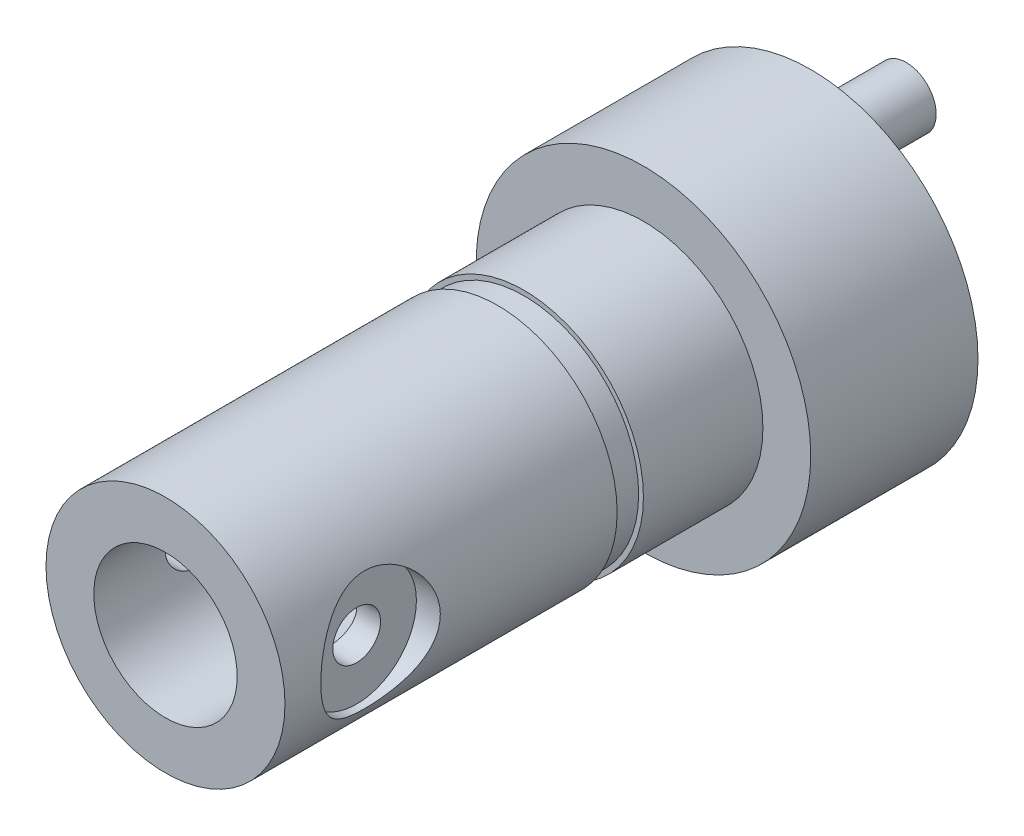
ISO-10303-21;
HEADER;
FILE_DESCRIPTION(('STEP AP214'),'2;1');
FILE_NAME('part.step','',(''),(''),'','','');
FILE_SCHEMA(('AUTOMOTIVE_DESIGN { 1 0 10303 214 1 1 1 1 }'));
ENDSEC;
DATA;
#1=APPLICATION_CONTEXT('core data for automotive mechanical design processes');
#2=APPLICATION_PROTOCOL_DEFINITION('international standard','automotive_design',2000,#1);
#3=PRODUCT_CONTEXT('',#1,'mechanical');
#4=PRODUCT('Part','Part','',(#3));
#5=PRODUCT_RELATED_PRODUCT_CATEGORY('part','',(#4));
#6=PRODUCT_DEFINITION_FORMATION('','',#4);
#7=PRODUCT_DEFINITION_CONTEXT('part definition',#1,'design');
#8=PRODUCT_DEFINITION('design','',#6,#7);
#9=PRODUCT_DEFINITION_SHAPE('','',#8);
#10=(LENGTH_UNIT() NAMED_UNIT(*) SI_UNIT(.MILLI.,.METRE.));
#11=(NAMED_UNIT(*) PLANE_ANGLE_UNIT() SI_UNIT($,.RADIAN.));
#12=(NAMED_UNIT(*) SI_UNIT($,.STERADIAN.) SOLID_ANGLE_UNIT());
#13=UNCERTAINTY_MEASURE_WITH_UNIT(LENGTH_MEASURE(1.E-05),#10,'distance_accuracy_value','');
#14=(GEOMETRIC_REPRESENTATION_CONTEXT(3) GLOBAL_UNCERTAINTY_ASSIGNED_CONTEXT((#13)) GLOBAL_UNIT_ASSIGNED_CONTEXT((#10,
#11,#12)) REPRESENTATION_CONTEXT('',''));
#15=CARTESIAN_POINT('',(0.,0.,0.));
#16=DIRECTION('',(0.,0.,1.));
#17=DIRECTION('',(1.,0.,0.));
#18=AXIS2_PLACEMENT_3D('',#15,#16,#17);
#19=CARTESIAN_POINT('',(-7.,0.,16.));
#20=DIRECTION('',(1.,0.,0.));
#21=DIRECTION('',(0.,0.,-1.));
#22=AXIS2_PLACEMENT_3D('',#19,#20,#21);
#23=CYLINDRICAL_SURFACE('',#22,1.);
#24=CARTESIAN_POINT('',(-3.,0.,15.));
#25=CARTESIAN_POINT('',(-3.00000015300943,0.0545633628867234,14.9999997462684));
#26=CARTESIAN_POINT('',(-2.99849769507545,0.10912519453855,15.0044802661272));
#27=CARTESIAN_POINT('',(-2.99265210203281,0.216641760872972,15.0222291088172));
#28=CARTESIAN_POINT('',(-2.98830867202153,0.269596328118818,15.0354983439489));
#29=CARTESIAN_POINT('',(-2.97725307906443,0.372332789501776,15.070319243384));
#30=CARTESIAN_POINT('',(-2.97054487730853,0.422119825886035,15.0918570624593));
#31=CARTESIAN_POINT('',(-2.95544445717342,0.517374936805325,15.1425411728383));
#32=CARTESIAN_POINT('',(-2.94705190667778,0.562842156958706,15.1716889650026));
#33=CARTESIAN_POINT('',(-2.92914094443005,0.649741675022267,15.2378258048588));
#34=CARTESIAN_POINT('',(-2.91959556463785,0.69100370029831,15.2750312342605));
#35=CARTESIAN_POINT('',(-2.90060314783122,0.766832692702085,15.3557671547066));
#36=CARTESIAN_POINT('',(-2.89115613290549,0.801398185489463,15.3992990349285));
#37=CARTESIAN_POINT('',(-2.87313332477274,0.86382494222786,15.4929851151965));
#38=CARTESIAN_POINT('',(-2.86459039275688,0.891464858221033,15.5432937397321));
#39=CARTESIAN_POINT('',(-2.84975305418601,0.937818873877723,15.6481760944585));
#40=CARTESIAN_POINT('',(-2.84345796160746,0.956535697386766,15.7027485171627));
#41=CARTESIAN_POINT('',(-2.83411303269377,0.983873461509165,15.8126732214967));
#42=CARTESIAN_POINT('',(-2.83096095769611,0.99281344827177,15.8679372084891));
#43=CARTESIAN_POINT('',(-2.82795656629508,1.00134112333448,15.9792637541559));
#44=CARTESIAN_POINT('',(-2.8281032302273,1.00093170160472,16.0353260607092));
#45=CARTESIAN_POINT('',(-2.8315901500818,0.991019903703421,16.143936630444));
#46=CARTESIAN_POINT('',(-2.83478415867533,0.981933913166996,16.196528402919));
#47=CARTESIAN_POINT('',(-2.84376657724551,0.955606162849419,16.2993934196068));
#48=CARTESIAN_POINT('',(-2.84955529784108,0.938363426591873,16.3496663854351));
#49=CARTESIAN_POINT('',(-2.86317911131249,0.895939058060213,16.4474127495915));
#50=CARTESIAN_POINT('',(-2.87104565793117,0.870634048707264,16.4948280254695));
#51=CARTESIAN_POINT('',(-2.88792558575726,0.812889106303141,16.5848709082797));
#52=CARTESIAN_POINT('',(-2.89693929790464,0.780447112364007,16.6274971269334));
#53=CARTESIAN_POINT('',(-2.91567329167741,0.70734933268224,16.7090915981608));
#54=CARTESIAN_POINT('',(-2.92540589354843,0.666353150076314,16.7477526945091));
#55=CARTESIAN_POINT('',(-2.94406938387037,0.578339569970067,16.8177312666634));
#56=CARTESIAN_POINT('',(-2.95300019538067,0.531321595660817,16.8490480381645));
#57=CARTESIAN_POINT('',(-2.96917107937794,0.43194761304627,16.9036963002351));
#58=CARTESIAN_POINT('',(-2.97639350008039,0.379543276416338,16.9269454913407));
#59=CARTESIAN_POINT('',(-2.98820567144435,0.271269083364508,16.9642031739557));
#60=CARTESIAN_POINT('',(-2.99279633654879,0.215400438154953,16.9782148754234));
#61=CARTESIAN_POINT('',(-2.99867627071441,0.104383829529303,16.9960556660224));
#62=CARTESIAN_POINT('',(-3.00010001833731,0.0493095998648445,17.0002998091728));
#63=CARTESIAN_POINT('',(-2.99988902694825,-0.0607750699602368,16.9996673264015));
#64=CARTESIAN_POINT('',(-2.99825480419352,-0.115785519319647,16.9947922400201));
#65=CARTESIAN_POINT('',(-2.99220024717114,-0.222519866304259,16.976388092264));
#66=CARTESIAN_POINT('',(-2.98786198711228,-0.274292806834857,16.9631137939505));
#67=CARTESIAN_POINT('',(-2.97691846830034,-0.374855958579562,16.9286065555333));
#68=CARTESIAN_POINT('',(-2.97031292046541,-0.423645788508561,16.9073726005323));
#69=CARTESIAN_POINT('',(-2.95528931287427,-0.518288296393322,16.8569295681591));
#70=CARTESIAN_POINT('',(-2.94682814756305,-0.56402995921733,16.8275254067164));
#71=CARTESIAN_POINT('',(-2.92905253915743,-0.650064830135404,16.7618058499869));
#72=CARTESIAN_POINT('',(-2.91973783591888,-0.690356367794894,16.7254883439698));
#73=CARTESIAN_POINT('',(-2.90076847982472,-0.766252507807013,16.6450212489917));
#74=CARTESIAN_POINT('',(-2.89111761095155,-0.801560969248491,16.6005907730668));
#75=CARTESIAN_POINT('',(-2.87299973286981,-0.864257522320854,16.5062284321955));
#76=CARTESIAN_POINT('',(-2.8645327335312,-0.891645547920844,16.4562965213898));
#77=CARTESIAN_POINT('',(-2.84982391820308,-0.937596930423361,16.3523269846934));
#78=CARTESIAN_POINT('',(-2.84357760900632,-0.956178132197767,16.2982979207572));
#79=CARTESIAN_POINT('',(-2.83410832399133,-0.983894666792164,16.1876213498759));
#80=CARTESIAN_POINT('',(-2.83088398622698,-0.993034254961244,16.1309750345669));
#81=CARTESIAN_POINT('',(-2.82797858875071,-1.00127628247038,16.0198029039868));
#82=CARTESIAN_POINT('',(-2.82812400344299,-1.00087025731093,15.9653176597483));
#83=CARTESIAN_POINT('',(-2.8315126992356,-0.991242293454879,15.8572349251003));
#84=CARTESIAN_POINT('',(-2.83475579595884,-0.982020879458888,15.8036373820471));
#85=CARTESIAN_POINT('',(-2.84384524278943,-0.955371813126981,15.6998643369873));
#86=CARTESIAN_POINT('',(-2.84964098015514,-0.938103346014881,15.6496431749928));
#87=CARTESIAN_POINT('',(-2.86316398825434,-0.895979365760383,15.5527725930645));
#88=CARTESIAN_POINT('',(-2.87089168765297,-0.871122168553981,15.5061239688127));
#89=CARTESIAN_POINT('',(-2.8878282922406,-0.813260692583251,15.4155163300763));
#90=CARTESIAN_POINT('',(-2.89708711641604,-0.779948242764533,15.3717634981014));
#91=CARTESIAN_POINT('',(-2.91583356283786,-0.706642883135698,15.290310186616));
#92=CARTESIAN_POINT('',(-2.92532124912518,-0.666648084451496,15.252611424312));
#93=CARTESIAN_POINT('',(-2.94390030525393,-0.579241556920676,15.1828555877108));
#94=CARTESIAN_POINT('',(-2.95296181801216,-0.531601513499727,15.151075652249));
#95=CARTESIAN_POINT('',(-2.96925991172652,-0.43135735740663,15.0960095711494));
#96=CARTESIAN_POINT('',(-2.9764969590794,-0.37875451813235,15.072721254078));
#97=CARTESIAN_POINT('',(-2.98805515068532,-0.272493647200976,15.0362783675113));
#98=CARTESIAN_POINT('',(-2.9924921242252,-0.218987757676409,15.0227175337366));
#99=CARTESIAN_POINT('',(-2.99846407064225,-0.110320416010248,15.0045797193229));
#100=CARTESIAN_POINT('',(-2.99999984531906,-0.0551594255687467,15.0000002565035));
#101=CARTESIAN_POINT('',(-3.,0.,15.));
#102=B_SPLINE_CURVE_WITH_KNOTS('',3,(#24,#25,#26,#27,#28,#29,#30,#31,#32,#33,#34,#35,#36,#37,
#38,#39,#40,#41,#42,#43,#44,#45,#46,#47,#48,#49,#50,#51,#52,#53,#54,#55,#56,#57,#58,#59,#60,#61,
#62,#63,#64,#65,#66,#67,#68,#69,#70,#71,#72,#73,#74,#75,#76,#77,#78,#79,#80,#81,#82,#83,#84,#85,
#86,#87,#88,#89,#90,#91,#92,#93,#94,#95,#96,#97,#98,#99,#100,#101),.UNSPECIFIED.,.T.,.F.,(4,2,2,
2,2,2,2,2,2,2,2,2,2,2,2,2,2,2,2,2,2,2,2,2,2,2,2,2,2,2,2,2,2,2,2,2,2,2,4),(0.,0.163487106026011,
0.326991185267521,0.490222672870274,0.653486377799101,0.82184684282756,0.990244332875303,
1.16348384823471,1.33667044692833,1.5040192574184,1.67131633987485,1.8309682655128,
1.99063930855482,2.15288171155131,2.31517102558207,2.48593305811367,2.65671145966618,
2.82918405650358,3.00159668877209,3.1665358317517,3.33144713164177,3.49158157978214,
3.65173645284104,3.81610399843737,3.98052180821892,4.15241022880752,4.32430008234997,
4.49584013824416,4.66730284700846,4.8299566605662,4.99260079341186,5.15215587070228,
5.31174638165788,5.47830066681616,5.6449021111359,5.81799660824911,5.99104681142267,
6.15636558363625,6.32163866027951),.UNSPECIFIED.);
#103=CARTESIAN_POINT('',(-3.,0.,15.));
#104=VERTEX_POINT('',#103);
#105=EDGE_CURVE('E101',#104,#104,#102,.T.);
#106=ORIENTED_EDGE('',*,*,#105,.T.);
#107=EDGE_LOOP('',(#106));
#108=FACE_BOUND('',#107,.T.);
#109=CARTESIAN_POINT('',(-4.,0.,16.));
#110=DIRECTION('',(-1.,0.,0.));
#111=DIRECTION('',(0.,0.,1.));
#112=AXIS2_PLACEMENT_3D('',#109,#110,#111);
#113=CIRCLE('',#112,1.);
#114=CARTESIAN_POINT('',(-4.,0.,17.));
#115=VERTEX_POINT('',#114);
#116=EDGE_CURVE('E45',#115,#115,#113,.F.);
#117=ORIENTED_EDGE('',*,*,#116,.F.);
#118=EDGE_LOOP('',(#117));
#119=FACE_BOUND('',#118,.T.);
#120=ADVANCED_FACE('F41',(#108,#119),#23,.F.);
#121=CARTESIAN_POINT('',(3.,0.,15.));
#122=CARTESIAN_POINT('',(3.00000015300943,-0.0545633628867234,14.9999997462684));
#123=CARTESIAN_POINT('',(2.99849769507545,-0.10912519453855,15.0044802661272));
#124=CARTESIAN_POINT('',(2.99265210203281,-0.216641760872972,15.0222291088172));
#125=CARTESIAN_POINT('',(2.98830867202153,-0.269596328118818,15.0354983439489));
#126=CARTESIAN_POINT('',(2.97725307906443,-0.372332789501776,15.070319243384));
#127=CARTESIAN_POINT('',(2.97054487730853,-0.422119825886035,15.0918570624593));
#128=CARTESIAN_POINT('',(2.95544445717342,-0.517374936805325,15.1425411728383));
#129=CARTESIAN_POINT('',(2.94705190667778,-0.562842156958706,15.1716889650026));
#130=CARTESIAN_POINT('',(2.92914094443005,-0.649741675022267,15.2378258048588));
#131=CARTESIAN_POINT('',(2.91959556463785,-0.69100370029831,15.2750312342605));
#132=CARTESIAN_POINT('',(2.90060314783122,-0.766832692702085,15.3557671547066));
#133=CARTESIAN_POINT('',(2.89115613290549,-0.801398185489463,15.3992990349285));
#134=CARTESIAN_POINT('',(2.87313332477274,-0.86382494222786,15.4929851151965));
#135=CARTESIAN_POINT('',(2.86459039275688,-0.891464858221033,15.5432937397321));
#136=CARTESIAN_POINT('',(2.84975305418601,-0.937818873877723,15.6481760944585));
#137=CARTESIAN_POINT('',(2.84345796160746,-0.956535697386766,15.7027485171627));
#138=CARTESIAN_POINT('',(2.83411303269377,-0.983873461509165,15.8126732214967));
#139=CARTESIAN_POINT('',(2.83096095769611,-0.99281344827177,15.8679372084891));
#140=CARTESIAN_POINT('',(2.82795656629508,-1.00134112333448,15.9792637541559));
#141=CARTESIAN_POINT('',(2.8281032302273,-1.00093170160472,16.0353260607092));
#142=CARTESIAN_POINT('',(2.8315901500818,-0.991019903703421,16.143936630444));
#143=CARTESIAN_POINT('',(2.83478415867533,-0.981933913166996,16.196528402919));
#144=CARTESIAN_POINT('',(2.84376657724551,-0.955606162849419,16.2993934196068));
#145=CARTESIAN_POINT('',(2.84955529784108,-0.938363426591873,16.3496663854351));
#146=CARTESIAN_POINT('',(2.86317911131249,-0.895939058060213,16.4474127495915));
#147=CARTESIAN_POINT('',(2.87104565793117,-0.870634048707264,16.4948280254695));
#148=CARTESIAN_POINT('',(2.88792558575726,-0.812889106303141,16.5848709082797));
#149=CARTESIAN_POINT('',(2.89693929790464,-0.780447112364007,16.6274971269334));
#150=CARTESIAN_POINT('',(2.91567329167741,-0.70734933268224,16.7090915981608));
#151=CARTESIAN_POINT('',(2.92540589354843,-0.666353150076314,16.7477526945091));
#152=CARTESIAN_POINT('',(2.94406938387037,-0.578339569970067,16.8177312666634));
#153=CARTESIAN_POINT('',(2.95300019538067,-0.531321595660817,16.8490480381645));
#154=CARTESIAN_POINT('',(2.96917107937794,-0.43194761304627,16.9036963002351));
#155=CARTESIAN_POINT('',(2.97639350008039,-0.379543276416338,16.9269454913407));
#156=CARTESIAN_POINT('',(2.98820567144435,-0.271269083364508,16.9642031739557));
#157=CARTESIAN_POINT('',(2.99279633654879,-0.215400438154953,16.9782148754234));
#158=CARTESIAN_POINT('',(2.99867627071441,-0.104383829529303,16.9960556660224));
#159=CARTESIAN_POINT('',(3.00010001833731,-0.0493095998648445,17.0002998091728));
#160=CARTESIAN_POINT('',(2.99988902694825,0.0607750699602368,16.9996673264015));
#161=CARTESIAN_POINT('',(2.99825480419352,0.115785519319647,16.9947922400201));
#162=CARTESIAN_POINT('',(2.99220024717114,0.222519866304259,16.976388092264));
#163=CARTESIAN_POINT('',(2.98786198711228,0.274292806834857,16.9631137939505));
#164=CARTESIAN_POINT('',(2.97691846830034,0.374855958579562,16.9286065555333));
#165=CARTESIAN_POINT('',(2.97031292046541,0.423645788508561,16.9073726005323));
#166=CARTESIAN_POINT('',(2.95528931287427,0.518288296393322,16.8569295681591));
#167=CARTESIAN_POINT('',(2.94682814756305,0.56402995921733,16.8275254067164));
#168=CARTESIAN_POINT('',(2.92905253915743,0.650064830135404,16.7618058499869));
#169=CARTESIAN_POINT('',(2.91973783591888,0.690356367794894,16.7254883439698));
#170=CARTESIAN_POINT('',(2.90076847982472,0.766252507807013,16.6450212489917));
#171=CARTESIAN_POINT('',(2.89111761095155,0.801560969248491,16.6005907730668));
#172=CARTESIAN_POINT('',(2.87299973286981,0.864257522320854,16.5062284321955));
#173=CARTESIAN_POINT('',(2.8645327335312,0.891645547920844,16.4562965213898));
#174=CARTESIAN_POINT('',(2.84982391820308,0.937596930423361,16.3523269846934));
#175=CARTESIAN_POINT('',(2.84357760900632,0.956178132197767,16.2982979207572));
#176=CARTESIAN_POINT('',(2.83410832399133,0.983894666792164,16.1876213498759));
#177=CARTESIAN_POINT('',(2.83088398622698,0.993034254961244,16.1309750345669));
#178=CARTESIAN_POINT('',(2.82797858875071,1.00127628247038,16.0198029039868));
#179=CARTESIAN_POINT('',(2.82812400344299,1.00087025731093,15.9653176597483));
#180=CARTESIAN_POINT('',(2.8315126992356,0.991242293454879,15.8572349251003));
#181=CARTESIAN_POINT('',(2.83475579595884,0.982020879458888,15.8036373820471));
#182=CARTESIAN_POINT('',(2.84384524278943,0.955371813126981,15.6998643369873));
#183=CARTESIAN_POINT('',(2.84964098015514,0.938103346014881,15.6496431749928));
#184=CARTESIAN_POINT('',(2.86316398825434,0.895979365760383,15.5527725930645));
#185=CARTESIAN_POINT('',(2.87089168765297,0.871122168553981,15.5061239688127));
#186=CARTESIAN_POINT('',(2.8878282922406,0.813260692583251,15.4155163300763));
#187=CARTESIAN_POINT('',(2.89708711641604,0.779948242764533,15.3717634981014));
#188=CARTESIAN_POINT('',(2.91583356283786,0.706642883135698,15.290310186616));
#189=CARTESIAN_POINT('',(2.92532124912518,0.666648084451496,15.252611424312));
#190=CARTESIAN_POINT('',(2.94390030525393,0.579241556920676,15.1828555877108));
#191=CARTESIAN_POINT('',(2.95296181801216,0.531601513499727,15.151075652249));
#192=CARTESIAN_POINT('',(2.96925991172652,0.43135735740663,15.0960095711494));
#193=CARTESIAN_POINT('',(2.9764969590794,0.37875451813235,15.072721254078));
#194=CARTESIAN_POINT('',(2.98805515068532,0.272493647200976,15.0362783675113));
#195=CARTESIAN_POINT('',(2.9924921242252,0.218987757676409,15.0227175337366));
#196=CARTESIAN_POINT('',(2.99846407064225,0.110320416010248,15.0045797193229));
#197=CARTESIAN_POINT('',(2.99999984531906,0.0551594255687467,15.0000002565035));
#198=CARTESIAN_POINT('',(3.,0.,15.));
#199=B_SPLINE_CURVE_WITH_KNOTS('',3,(#121,#122,#123,#124,#125,#126,#127,#128,#129,#130,#131,
#132,#133,#134,#135,#136,#137,#138,#139,#140,#141,#142,#143,#144,#145,#146,#147,#148,#149,#150,
#151,#152,#153,#154,#155,#156,#157,#158,#159,#160,#161,#162,#163,#164,#165,#166,#167,#168,#169,
#170,#171,#172,#173,#174,#175,#176,#177,#178,#179,#180,#181,#182,#183,#184,#185,#186,#187,#188,
#189,#190,#191,#192,#193,#194,#195,#196,#197,#198),.UNSPECIFIED.,.T.,.F.,(4,2,2,2,2,2,2,2,2,2,2,
2,2,2,2,2,2,2,2,2,2,2,2,2,2,2,2,2,2,2,2,2,2,2,2,2,2,2,4),(0.,0.163487106026011,
0.326991185267521,0.490222672870274,0.653486377799101,0.82184684282756,0.990244332875303,
1.16348384823471,1.33667044692833,1.5040192574184,1.67131633987485,1.8309682655128,
1.99063930855482,2.15288171155131,2.31517102558207,2.48593305811367,2.65671145966618,
2.82918405650358,3.00159668877209,3.1665358317517,3.33144713164177,3.49158157978214,
3.65173645284104,3.81610399843737,3.98052180821892,4.15241022880752,4.32430008234997,
4.49584013824416,4.66730284700846,4.8299566605662,4.99260079341186,5.15215587070228,
5.31174638165788,5.47830066681616,5.6449021111359,5.81799660824911,5.99104681142267,
6.15636558363625,6.32163866027951),.UNSPECIFIED.);
#200=CARTESIAN_POINT('',(3.,0.,15.));
#201=VERTEX_POINT('',#200);
#202=EDGE_CURVE('E95',#201,#201,#199,.T.);
#203=ORIENTED_EDGE('',*,*,#202,.T.);
#204=EDGE_LOOP('',(#203));
#205=FACE_BOUND('',#204,.T.);
#206=CARTESIAN_POINT('',(4.,0.,16.));
#207=DIRECTION('',(1.,0.,0.));
#208=DIRECTION('',(0.,0.,-1.));
#209=AXIS2_PLACEMENT_3D('',#206,#207,#208);
#210=CIRCLE('',#209,1.);
#211=CARTESIAN_POINT('',(4.,0.,15.));
#212=VERTEX_POINT('',#211);
#213=EDGE_CURVE('E131',#212,#212,#210,.F.);
#214=ORIENTED_EDGE('',*,*,#213,.F.);
#215=EDGE_LOOP('',(#214));
#216=FACE_BOUND('',#215,.T.);
#217=ADVANCED_FACE('F87',(#205,#216),#23,.F.);
#218=CARTESIAN_POINT('',(0.,0.,20.));
#219=DIRECTION('',(0.,0.,-1.));
#220=DIRECTION('',(-1.,0.,0.));
#221=AXIS2_PLACEMENT_3D('',#218,#219,#220);
#222=CYLINDRICAL_SURFACE('',#221,5.);
#223=CARTESIAN_POINT('',(0.,0.,20.));
#224=DIRECTION('',(0.,0.,1.));
#225=DIRECTION('',(1.,0.,0.));
#226=AXIS2_PLACEMENT_3D('',#223,#224,#225);
#227=CIRCLE('',#226,5.);
#228=CARTESIAN_POINT('',(5.,0.,20.));
#229=VERTEX_POINT('',#228);
#230=EDGE_CURVE('E285',#229,#229,#227,.T.);
#231=ORIENTED_EDGE('',*,*,#230,.F.);
#232=EDGE_LOOP('',(#231));
#233=FACE_BOUND('',#232,.T.);
#234=CARTESIAN_POINT('',(0.,0.,6.1));
#235=DIRECTION('',(0.,0.,1.));
#236=DIRECTION('',(1.,0.,0.));
#237=AXIS2_PLACEMENT_3D('',#234,#235,#236);
#238=CIRCLE('',#237,5.);
#239=CARTESIAN_POINT('',(5.,0.,6.1));
#240=VERTEX_POINT('',#239);
#241=EDGE_CURVE('E290',#240,#240,#238,.T.);
#242=ORIENTED_EDGE('',*,*,#241,.T.);
#243=EDGE_LOOP('',(#242));
#244=FACE_BOUND('',#243,.T.);
#245=CARTESIAN_POINT('',(5.,0.,13.5));
#246=CARTESIAN_POINT('',(4.99999177550472,-0.131426682334305,13.500009669056));
#247=CARTESIAN_POINT('',(4.99476199135277,-0.263015634437212,13.510425561774));
#248=CARTESIAN_POINT('',(4.9743541856102,-0.522301454622882,13.5516318211621));
#249=CARTESIAN_POINT('',(4.9591572718767,-0.649990448564104,13.582460880925));
#250=CARTESIAN_POINT('',(4.92040690922477,-0.897333631316202,13.6629846227188));
#251=CARTESIAN_POINT('',(4.89688595907259,-1.01701694536277,13.7126059877827));
#252=CARTESIAN_POINT('',(4.84364443325827,-1.24618160399671,13.8289265262518));
#253=CARTESIAN_POINT('',(4.81392434644421,-1.3556637520377,13.8956243531451));
#254=CARTESIAN_POINT('',(4.74890645050632,-1.56876952630998,14.0487931316426));
#255=CARTESIAN_POINT('',(4.71337997659091,-1.67163802294308,14.1362162002298));
#256=CARTESIAN_POINT('',(4.64149925776731,-1.86194861703332,14.3263036959853));
#257=CARTESIAN_POINT('',(4.60514440566897,-1.94937895911555,14.4289796288401));
#258=CARTESIAN_POINT('',(4.53247377945622,-2.11312999967247,14.6562083744453));
#259=CARTESIAN_POINT('',(4.49637967412567,-2.18806333849064,14.781840246035));
#260=CARTESIAN_POINT('',(4.43214946943555,-2.31542056761491,15.0459183397954));
#261=CARTESIAN_POINT('',(4.40400769020792,-2.36786053751682,15.1843553217626));
#262=CARTESIAN_POINT('',(4.36144667591402,-2.44533110537653,15.4616627635964));
#263=CARTESIAN_POINT('',(4.34630678958452,-2.47181464267578,15.6000111301796));
#264=CARTESIAN_POINT('',(4.3295472487215,-2.50106748329741,15.8799470944376));
#265=CARTESIAN_POINT('',(4.3279142335843,-2.50386022093906,16.0215313521751));
#266=CARTESIAN_POINT('',(4.33777325642937,-2.48671821792512,16.2857150607909));
#267=CARTESIAN_POINT('',(4.34771909154984,-2.46946139884055,16.4085600780583));
#268=CARTESIAN_POINT('',(4.37690571834675,-2.41734962264384,16.6493047734319));
#269=CARTESIAN_POINT('',(4.39614947079454,-2.38248905974454,16.7672028632631));
#270=CARTESIAN_POINT('',(4.44218691031839,-2.29552445096459,16.9980728314143));
#271=CARTESIAN_POINT('',(4.46914601659993,-2.24303766778987,17.1108659969645));
#272=CARTESIAN_POINT('',(4.52758510703513,-2.12260421917012,17.326585731475));
#273=CARTESIAN_POINT('',(4.55906711950478,-2.0546506095312,17.4295078390002));
#274=CARTESIAN_POINT('',(4.62782894758213,-1.89516513728194,17.6363031318581));
#275=CARTESIAN_POINT('',(4.66533775591865,-1.80173614592319,17.7386421839404));
#276=CARTESIAN_POINT('',(4.73869058251019,-1.59888894685344,17.9268385464772));
#277=CARTESIAN_POINT('',(4.77453379897003,-1.48946314143571,18.0126879800847));
#278=CARTESIAN_POINT('',(4.84254968207409,-1.25129126457962,18.1692141525743));
#279=CARTESIAN_POINT('',(4.87447460405015,-1.12188397899853,18.2390011811144));
#280=CARTESIAN_POINT('',(4.92894702803109,-0.851165538721983,18.3552425726075));
#281=CARTESIAN_POINT('',(4.95150197358893,-0.70986394066316,18.4017154625379));
#282=CARTESIAN_POINT('',(4.98310834353579,-0.431916229151779,18.4661885092917));
#283=CARTESIAN_POINT('',(4.9931234575324,-0.295853826370905,18.486228089367));
#284=CARTESIAN_POINT('',(5.00182533647794,-0.0219489998732879,18.5036618278362));
#285=CARTESIAN_POINT('',(5.00051746803426,0.115892549675109,18.5010667140985));
#286=CARTESIAN_POINT('',(4.98727980633468,0.378082429964656,18.4744832789533));
#287=CARTESIAN_POINT('',(4.97618114219992,0.502648520123705,18.4521686681756));
#288=CARTESIAN_POINT('',(4.94555428287529,0.746017230755971,18.3894048202616));
#289=CARTESIAN_POINT('',(4.92602515837625,0.864819214231882,18.3489535838641));
#290=CARTESIAN_POINT('',(4.87960628532329,1.09722152111965,18.2500038339196));
#291=CARTESIAN_POINT('',(4.85252204417873,1.21057599249831,18.1910223747177));
#292=CARTESIAN_POINT('',(4.7935993579975,1.42615340426439,18.0572311608752));
#293=CARTESIAN_POINT('',(4.76175888940534,1.52837157450203,17.9824146634801));
#294=CARTESIAN_POINT('',(4.69270553315087,1.72941922315487,17.8105989367091));
#295=CARTESIAN_POINT('',(4.65527212009488,1.82693019428496,17.7121428290248));
#296=CARTESIAN_POINT('',(4.58155978921587,2.0046408025722,17.5001871219506));
#297=CARTESIAN_POINT('',(4.54528168472407,2.08482846428685,17.3866772029301));
#298=CARTESIAN_POINT('',(4.4762798054528,2.22926978618995,17.1408908645153));
#299=CARTESIAN_POINT('',(4.44381323981254,2.29256373922243,17.0079718347089));
#300=CARTESIAN_POINT('',(4.38935180726746,2.39520706511459,16.7312248311174));
#301=CARTESIAN_POINT('',(4.36734345549014,2.43458729077055,16.587411184));
#302=CARTESIAN_POINT('',(4.33903752569351,2.48465421767005,16.3077244426371));
#303=CARTESIAN_POINT('',(4.33143458674096,2.4977324874436,16.172414365881));
#304=CARTESIAN_POINT('',(4.32913386592579,2.50172288950898,15.9013823326193));
#305=CARTESIAN_POINT('',(4.33443049025111,2.49264462983266,15.7656605801264));
#306=CARTESIAN_POINT('',(4.35594655164663,2.45481530197331,15.5112912443832));
#307=CARTESIAN_POINT('',(4.37107736338133,2.42802074302696,15.3922488182792));
#308=CARTESIAN_POINT('',(4.40927540337602,2.35793843840543,15.1604797078));
#309=CARTESIAN_POINT('',(4.43234518434965,2.31464538728732,15.0477550684335));
#310=CARTESIAN_POINT('',(4.48571326433413,2.20953919315538,14.8234378472803));
#311=CARTESIAN_POINT('',(4.5163930799845,2.14667719009403,14.712430148265));
#312=CARTESIAN_POINT('',(4.58088327077455,2.0053780838799,14.50181375676));
#313=CARTESIAN_POINT('',(4.61469526970767,1.92693287765888,14.4022110373713));
#314=CARTESIAN_POINT('',(4.68655816327011,1.74550556946065,14.2046446362504));
#315=CARTESIAN_POINT('',(4.72462491514981,1.6407002246921,14.1083506358286));
#316=CARTESIAN_POINT('',(4.79694347383545,1.41539785420684,13.934344150572));
#317=CARTESIAN_POINT('',(4.83119321905446,1.29489242426332,13.8566416813941));
#318=CARTESIAN_POINT('',(4.89245149457782,1.03978808878536,13.7219030205159));
#319=CARTESIAN_POINT('',(4.91940711437488,0.905095560782285,13.6650168322155));
#320=CARTESIAN_POINT('',(4.95177960923351,0.696328709257349,13.5978161412076));
#321=CARTESIAN_POINT('',(4.96122314081874,0.625670413494086,13.5784446019982));
#322=CARTESIAN_POINT('',(4.97717127275101,0.482623997839256,13.5459340516294));
#323=CARTESIAN_POINT('',(4.98367766823159,0.4102369630924,13.5327912333237));
#324=CARTESIAN_POINT('',(4.9923820076613,0.28151868462167,13.5152625277154));
#325=CARTESIAN_POINT('',(4.99523288466454,0.225408499555444,13.5095450634687));
#326=CARTESIAN_POINT('',(4.99904367329659,0.112875528456289,13.5019116705343));
#327=CARTESIAN_POINT('',(5.00000353273198,0.056452733838218,13.4999958467745));
#328=CARTESIAN_POINT('',(5.,0.,13.5));
#329=B_SPLINE_CURVE_WITH_KNOTS('',3,(#245,#246,#247,#248,#249,#250,#251,#252,#253,#254,#255,
#256,#257,#258,#259,#260,#261,#262,#263,#264,#265,#266,#267,#268,#269,#270,#271,#272,#273,#274,
#275,#276,#277,#278,#279,#280,#281,#282,#283,#284,#285,#286,#287,#288,#289,#290,#291,#292,#293,
#294,#295,#296,#297,#298,#299,#300,#301,#302,#303,#304,#305,#306,#307,#308,#309,#310,#311,#312,
#313,#314,#315,#316,#317,#318,#319,#320,#321,#322,#323,#324,#325,#326,#327,#328),.UNSPECIFIED.,
.T.,.F.,(4,2,2,2,2,2,2,2,2,2,2,2,2,2,2,2,2,2,2,2,2,2,2,2,2,2,2,2,2,2,2,2,2,2,2,2,2,2,2,2,2,4),
(0.,0.394060643550731,0.788870374272993,1.18215538873075,1.57540940145392,1.99245439679522,
2.40981559413509,2.85954316076882,3.30894869745702,3.73145030350574,4.1535339332255,
4.52514281023301,4.89687009814196,5.27725600421218,5.65781303150554,6.08662353334696,
6.51563836496716,6.96457555536101,7.41315542280699,7.82458226178364,8.2358141127869,
8.61517266265304,8.99457304077328,9.38482140069746,9.77523626870848,10.2039902661037,
10.6330397153795,11.0828670540368,11.53211279863,11.9382326875698,12.3441764966106,
12.7114482562151,13.0788382197025,13.4709114195009,13.8631890285845,14.303131068923,
14.7433095845248,15.1866003415819,15.407934939208,15.6291340766843,15.7983933645035,
15.9676573239322),.UNSPECIFIED.);
#330=CARTESIAN_POINT('',(5.,0.,13.5));
#331=VERTEX_POINT('',#330);
#332=EDGE_CURVE('E49',#331,#331,#329,.T.);
#333=ORIENTED_EDGE('',*,*,#332,.T.);
#334=EDGE_LOOP('',(#333));
#335=FACE_BOUND('',#334,.T.);
#336=CARTESIAN_POINT('',(-5.,0.,18.5));
#337=CARTESIAN_POINT('',(-4.99999177550472,0.131426682334305,18.499990330944));
#338=CARTESIAN_POINT('',(-4.99476199135277,0.263015634437212,18.489574438226));
#339=CARTESIAN_POINT('',(-4.9743541856102,0.522301454622882,18.4483681788379));
#340=CARTESIAN_POINT('',(-4.9591572718767,0.649990448564105,18.417539119075));
#341=CARTESIAN_POINT('',(-4.92040690922477,0.897333631316203,18.3370153772812));
#342=CARTESIAN_POINT('',(-4.89688595907259,1.01701694536277,18.2873940122173));
#343=CARTESIAN_POINT('',(-4.84364443325827,1.24618160399671,18.1710734737482));
#344=CARTESIAN_POINT('',(-4.81392434644421,1.3556637520377,18.1043756468549));
#345=CARTESIAN_POINT('',(-4.74890645050632,1.56876952630998,17.9512068683574));
#346=CARTESIAN_POINT('',(-4.71337997659091,1.67163802294308,17.8637837997702));
#347=CARTESIAN_POINT('',(-4.64149925776731,1.86194861703332,17.6736963040147));
#348=CARTESIAN_POINT('',(-4.60514440566897,1.94937895911555,17.5710203711599));
#349=CARTESIAN_POINT('',(-4.53247377945622,2.11312999967247,17.3437916255547));
#350=CARTESIAN_POINT('',(-4.49637967412567,2.18806333849064,17.218159753965));
#351=CARTESIAN_POINT('',(-4.43214946943555,2.31542056761491,16.9540816602046));
#352=CARTESIAN_POINT('',(-4.40400769020792,2.36786053751682,16.8156446782374));
#353=CARTESIAN_POINT('',(-4.36144667591402,2.44533110537653,16.5383372364036));
#354=CARTESIAN_POINT('',(-4.34630678958452,2.47181464267578,16.3999888698204));
#355=CARTESIAN_POINT('',(-4.3295472487215,2.50106748329741,16.1200529055624));
#356=CARTESIAN_POINT('',(-4.3279142335843,2.50386022093906,15.9784686478249));
#357=CARTESIAN_POINT('',(-4.33777325642937,2.48671821792512,15.7142849392091));
#358=CARTESIAN_POINT('',(-4.34771909154984,2.46946139884055,15.5914399219417));
#359=CARTESIAN_POINT('',(-4.37690571834675,2.41734962264384,15.3506952265681));
#360=CARTESIAN_POINT('',(-4.39614947079454,2.38248905974454,15.2327971367369));
#361=CARTESIAN_POINT('',(-4.44218691031839,2.29552445096459,15.0019271685857));
#362=CARTESIAN_POINT('',(-4.46914601659993,2.24303766778987,14.8891340030355));
#363=CARTESIAN_POINT('',(-4.52758510703513,2.12260421917012,14.673414268525));
#364=CARTESIAN_POINT('',(-4.55906711950478,2.0546506095312,14.5704921609998));
#365=CARTESIAN_POINT('',(-4.62782894758213,1.89516513728193,14.3636968681419));
#366=CARTESIAN_POINT('',(-4.66533775591865,1.80173614592319,14.2613578160596));
#367=CARTESIAN_POINT('',(-4.73869058251019,1.59888894685344,14.0731614535228));
#368=CARTESIAN_POINT('',(-4.77453379897003,1.48946314143571,13.9873120199153));
#369=CARTESIAN_POINT('',(-4.84254968207409,1.25129126457962,13.8307858474257));
#370=CARTESIAN_POINT('',(-4.87447460405015,1.12188397899853,13.7609988188856));
#371=CARTESIAN_POINT('',(-4.92894702803109,0.851165538721983,13.6447574273925));
#372=CARTESIAN_POINT('',(-4.95150197358893,0.709863940663161,13.5982845374621));
#373=CARTESIAN_POINT('',(-4.98310834353579,0.43191622915178,13.5338114907083));
#374=CARTESIAN_POINT('',(-4.9931234575324,0.295853826370905,13.513771910633));
#375=CARTESIAN_POINT('',(-5.00182533647794,0.0219489998732874,13.4963381721638));
#376=CARTESIAN_POINT('',(-5.00051746803426,-0.11589254967511,13.4989332859015));
#377=CARTESIAN_POINT('',(-4.98727980633468,-0.378082429964657,13.5255167210467));
#378=CARTESIAN_POINT('',(-4.97618114219992,-0.502648520123706,13.5478313318244));
#379=CARTESIAN_POINT('',(-4.94555428287529,-0.746017230755972,13.6105951797384));
#380=CARTESIAN_POINT('',(-4.92602515837625,-0.864819214231883,13.6510464161359));
#381=CARTESIAN_POINT('',(-4.87960628532329,-1.09722152111965,13.7499961660804));
#382=CARTESIAN_POINT('',(-4.85252204417873,-1.21057599249831,13.8089776252823));
#383=CARTESIAN_POINT('',(-4.7935993579975,-1.42615340426439,13.9427688391248));
#384=CARTESIAN_POINT('',(-4.76175888940534,-1.52837157450203,14.0175853365199));
#385=CARTESIAN_POINT('',(-4.69270553315087,-1.72941922315487,14.1894010632909));
#386=CARTESIAN_POINT('',(-4.65527212009488,-1.82693019428496,14.2878571709752));
#387=CARTESIAN_POINT('',(-4.58155978921587,-2.0046408025722,14.4998128780494));
#388=CARTESIAN_POINT('',(-4.54528168472407,-2.08482846428685,14.6133227970699));
#389=CARTESIAN_POINT('',(-4.4762798054528,-2.22926978618995,14.8591091354847));
#390=CARTESIAN_POINT('',(-4.44381323981254,-2.29256373922243,14.9920281652911));
#391=CARTESIAN_POINT('',(-4.38935180726746,-2.39520706511459,15.2687751688826));
#392=CARTESIAN_POINT('',(-4.36734345549014,-2.43458729077055,15.412588816));
#393=CARTESIAN_POINT('',(-4.33903752569351,-2.48465421767005,15.6922755573629));
#394=CARTESIAN_POINT('',(-4.33143458674096,-2.4977324874436,15.827585634119));
#395=CARTESIAN_POINT('',(-4.32913386592579,-2.50172288950898,16.0986176673807));
#396=CARTESIAN_POINT('',(-4.33443049025111,-2.49264462983266,16.2343394198736));
#397=CARTESIAN_POINT('',(-4.35594655164663,-2.45481530197332,16.4887087556168));
#398=CARTESIAN_POINT('',(-4.37107736338133,-2.42802074302696,16.6077511817208));
#399=CARTESIAN_POINT('',(-4.40927540337602,-2.35793843840544,16.8395202922));
#400=CARTESIAN_POINT('',(-4.43234518434965,-2.31464538728732,16.9522449315665));
#401=CARTESIAN_POINT('',(-4.48571326433413,-2.20953919315538,17.1765621527197));
#402=CARTESIAN_POINT('',(-4.5163930799845,-2.14667719009403,17.287569851735));
#403=CARTESIAN_POINT('',(-4.58088327077455,-2.0053780838799,17.49818624324));
#404=CARTESIAN_POINT('',(-4.61469526970767,-1.92693287765888,17.5977889626287));
#405=CARTESIAN_POINT('',(-4.68655816327011,-1.74550556946065,17.7953553637496));
#406=CARTESIAN_POINT('',(-4.72462491514981,-1.64070022469209,17.8916493641714));
#407=CARTESIAN_POINT('',(-4.79694347383545,-1.41539785420683,18.065655849428));
#408=CARTESIAN_POINT('',(-4.83119321905446,-1.29489242426332,18.1433583186059));
#409=CARTESIAN_POINT('',(-4.89245149457782,-1.03978808878536,18.2780969794841));
#410=CARTESIAN_POINT('',(-4.91940711437488,-0.905095560782286,18.3349831677845));
#411=CARTESIAN_POINT('',(-4.9517796092335,-0.69632870925735,18.4021838587924));
#412=CARTESIAN_POINT('',(-4.96122314081874,-0.625670413494087,18.4215553980018));
#413=CARTESIAN_POINT('',(-4.97717127275101,-0.482623997839256,18.4540659483706));
#414=CARTESIAN_POINT('',(-4.98367766823159,-0.4102369630924,18.4672087666763));
#415=CARTESIAN_POINT('',(-4.9923820076613,-0.28151868462167,18.4847374722846));
#416=CARTESIAN_POINT('',(-4.99523288466454,-0.225408499555444,18.4904549365313));
#417=CARTESIAN_POINT('',(-4.99904367329659,-0.112875528456289,18.4980883294657));
#418=CARTESIAN_POINT('',(-5.00000353273198,-0.056452733838218,18.5000041532255));
#419=CARTESIAN_POINT('',(-5.,0.,18.5));
#420=B_SPLINE_CURVE_WITH_KNOTS('',3,(#336,#337,#338,#339,#340,#341,#342,#343,#344,#345,#346,
#347,#348,#349,#350,#351,#352,#353,#354,#355,#356,#357,#358,#359,#360,#361,#362,#363,#364,#365,
#366,#367,#368,#369,#370,#371,#372,#373,#374,#375,#376,#377,#378,#379,#380,#381,#382,#383,#384,
#385,#386,#387,#388,#389,#390,#391,#392,#393,#394,#395,#396,#397,#398,#399,#400,#401,#402,#403,
#404,#405,#406,#407,#408,#409,#410,#411,#412,#413,#414,#415,#416,#417,#418,#419),.UNSPECIFIED.,
.T.,.F.,(4,2,2,2,2,2,2,2,2,2,2,2,2,2,2,2,2,2,2,2,2,2,2,2,2,2,2,2,2,2,2,2,2,2,2,2,2,2,2,2,2,4),
(0.,0.394060643550731,0.788870374272994,1.18215538873075,1.57540940145392,1.99245439679522,
2.40981559413509,2.85954316076881,3.30894869745702,3.73145030350574,4.15353393322551,
4.52514281023301,4.89687009814196,5.27725600421218,5.65781303150554,6.08662353334696,
6.51563836496716,6.96457555536101,7.41315542280698,7.82458226178364,8.2358141127869,
8.61517266265304,8.99457304077328,9.38482140069746,9.77523626870848,10.2039902661037,
10.6330397153795,11.0828670540368,11.53211279863,11.9382326875698,12.3441764966106,
12.7114482562151,13.0788382197025,13.4709114195009,13.8631890285845,14.303131068923,
14.7433095845248,15.1866003415818,15.407934939208,15.6291340766843,15.7983933645035,
15.9676573239322),.UNSPECIFIED.);
#421=CARTESIAN_POINT('',(-5.,0.,18.5));
#422=VERTEX_POINT('',#421);
#423=EDGE_CURVE('E10',#422,#422,#420,.T.);
#424=ORIENTED_EDGE('',*,*,#423,.F.);
#425=EDGE_LOOP('',(#424));
#426=FACE_BOUND('',#425,.T.);
#427=ADVANCED_FACE('F65',(#233,#244,#335,#426),#222,.T.);
#428=CARTESIAN_POINT('',(0.,0.,0.));
#429=DIRECTION('',(0.,0.,1.));
#430=DIRECTION('',(1.,0.,0.));
#431=AXIS2_PLACEMENT_3D('',#428,#429,#430);
#432=CIRCLE('',#431,5.);
#433=CARTESIAN_POINT('',(5.,0.,0.));
#434=VERTEX_POINT('',#433);
#435=EDGE_CURVE('E287',#434,#434,#432,.T.);
#436=ORIENTED_EDGE('',*,*,#435,.T.);
#437=EDGE_LOOP('',(#436));
#438=FACE_BOUND('',#437,.T.);
#439=CARTESIAN_POINT('',(0.,0.,5.));
#440=DIRECTION('',(0.,0.,1.));
#441=DIRECTION('',(1.,0.,0.));
#442=AXIS2_PLACEMENT_3D('',#439,#440,#441);
#443=CIRCLE('',#442,5.);
#444=CARTESIAN_POINT('',(5.,0.,5.));
#445=VERTEX_POINT('',#444);
#446=EDGE_CURVE('E294',#445,#445,#443,.T.);
#447=ORIENTED_EDGE('',*,*,#446,.F.);
#448=EDGE_LOOP('',(#447));
#449=FACE_BOUND('',#448,.T.);
#450=ADVANCED_FACE('F186',(#438,#449),#222,.T.);
#451=CARTESIAN_POINT('',(0.,0.,-7.));
#452=DIRECTION('',(0.,0.,1.));
#453=DIRECTION('',(1.,0.,0.));
#454=AXIS2_PLACEMENT_3D('',#451,#452,#453);
#455=CYLINDRICAL_SURFACE('',#454,7.);
#456=CARTESIAN_POINT('',(0.,0.,-7.));
#457=DIRECTION('',(0.,0.,1.));
#458=DIRECTION('',(1.,0.,0.));
#459=AXIS2_PLACEMENT_3D('',#456,#457,#458);
#460=CIRCLE('',#459,7.);
#461=CARTESIAN_POINT('',(7.,0.,-7.));
#462=VERTEX_POINT('',#461);
#463=EDGE_CURVE('E280',#462,#462,#460,.T.);
#464=ORIENTED_EDGE('',*,*,#463,.T.);
#465=EDGE_LOOP('',(#464));
#466=FACE_BOUND('',#465,.T.);
#467=CARTESIAN_POINT('',(0.,0.,0.));
#468=DIRECTION('',(0.,0.,1.));
#469=DIRECTION('',(1.,0.,0.));
#470=AXIS2_PLACEMENT_3D('',#467,#468,#469);
#471=CIRCLE('',#470,7.);
#472=CARTESIAN_POINT('',(7.,0.,0.));
#473=VERTEX_POINT('',#472);
#474=EDGE_CURVE('E283',#473,#473,#471,.T.);
#475=ORIENTED_EDGE('',*,*,#474,.F.);
#476=EDGE_LOOP('',(#475));
#477=FACE_BOUND('',#476,.T.);
#478=ADVANCED_FACE('F43',(#466,#477),#455,.T.);
#479=CARTESIAN_POINT('',(0.,0.,-7.));
#480=DIRECTION('',(0.,0.,1.));
#481=DIRECTION('',(1.,0.,0.));
#482=AXIS2_PLACEMENT_3D('',#479,#480,#481);
#483=PLANE('',#482);
#484=CARTESIAN_POINT('',(0.,4.,-7.));
#485=DIRECTION('',(0.,0.,1.));
#486=DIRECTION('',(1.,0.,0.));
#487=AXIS2_PLACEMENT_3D('',#484,#485,#486);
#488=CIRCLE('',#487,1.25);
#489=CARTESIAN_POINT('',(1.25,4.,-7.));
#490=VERTEX_POINT('',#489);
#491=EDGE_CURVE('E53',#490,#490,#488,.F.);
#492=ORIENTED_EDGE('',*,*,#491,.F.);
#493=EDGE_LOOP('',(#492));
#494=FACE_BOUND('',#493,.T.);
#495=ORIENTED_EDGE('',*,*,#463,.F.);
#496=EDGE_LOOP('',(#495));
#497=FACE_BOUND('',#496,.T.);
#498=ADVANCED_FACE('F259',(#494,#497),#483,.F.);
#499=CARTESIAN_POINT('',(0.,0.,0.));
#500=DIRECTION('',(0.,0.,1.));
#501=DIRECTION('',(1.,0.,0.));
#502=AXIS2_PLACEMENT_3D('',#499,#500,#501);
#503=PLANE('',#502);
#504=ORIENTED_EDGE('',*,*,#435,.F.);
#505=EDGE_LOOP('',(#504));
#506=FACE_BOUND('',#505,.T.);
#507=ORIENTED_EDGE('',*,*,#474,.T.);
#508=EDGE_LOOP('',(#507));
#509=FACE_BOUND('',#508,.T.);
#510=ADVANCED_FACE('F242',(#506,#509),#503,.T.);
#511=CARTESIAN_POINT('',(0.,0.,6.1));
#512=DIRECTION('',(0.,0.,1.));
#513=DIRECTION('',(1.,0.,0.));
#514=AXIS2_PLACEMENT_3D('',#511,#512,#513);
#515=PLANE('',#514);
#516=CARTESIAN_POINT('',(0.,0.,6.1));
#517=DIRECTION('',(0.,0.,1.));
#518=DIRECTION('',(1.,0.,0.));
#519=AXIS2_PLACEMENT_3D('',#516,#517,#518);
#520=CIRCLE('',#519,4.8);
#521=CARTESIAN_POINT('',(4.8,0.,6.1));
#522=VERTEX_POINT('',#521);
#523=EDGE_CURVE('E297',#522,#522,#520,.T.);
#524=ORIENTED_EDGE('',*,*,#523,.T.);
#525=EDGE_LOOP('',(#524));
#526=FACE_BOUND('',#525,.T.);
#527=ORIENTED_EDGE('',*,*,#241,.F.);
#528=EDGE_LOOP('',(#527));
#529=FACE_BOUND('',#528,.T.);
#530=ADVANCED_FACE('F233',(#526,#529),#515,.F.);
#531=CARTESIAN_POINT('',(0.,0.,5.));
#532=DIRECTION('',(0.,0.,1.));
#533=DIRECTION('',(1.,0.,0.));
#534=AXIS2_PLACEMENT_3D('',#531,#532,#533);
#535=PLANE('',#534);
#536=CARTESIAN_POINT('',(0.,0.,5.));
#537=DIRECTION('',(0.,0.,1.));
#538=DIRECTION('',(1.,0.,0.));
#539=AXIS2_PLACEMENT_3D('',#536,#537,#538);
#540=CIRCLE('',#539,4.8);
#541=CARTESIAN_POINT('',(4.8,0.,5.));
#542=VERTEX_POINT('',#541);
#543=EDGE_CURVE('E306',#542,#542,#540,.T.);
#544=ORIENTED_EDGE('',*,*,#543,.F.);
#545=EDGE_LOOP('',(#544));
#546=FACE_BOUND('',#545,.T.);
#547=ORIENTED_EDGE('',*,*,#446,.T.);
#548=EDGE_LOOP('',(#547));
#549=FACE_BOUND('',#548,.T.);
#550=ADVANCED_FACE('F223',(#546,#549),#535,.T.);
#551=CARTESIAN_POINT('',(0.,0.,6.1));
#552=DIRECTION('',(0.,0.,-1.));
#553=DIRECTION('',(-1.,0.,0.));
#554=AXIS2_PLACEMENT_3D('',#551,#552,#553);
#555=CYLINDRICAL_SURFACE('',#554,4.8);
#556=ORIENTED_EDGE('',*,*,#523,.F.);
#557=EDGE_LOOP('',(#556));
#558=FACE_BOUND('',#557,.T.);
#559=ORIENTED_EDGE('',*,*,#543,.T.);
#560=EDGE_LOOP('',(#559));
#561=FACE_BOUND('',#560,.T.);
#562=ADVANCED_FACE('F170',(#558,#561),#555,.T.);
#563=CARTESIAN_POINT('',(0.,0.,20.));
#564=DIRECTION('',(0.,0.,1.));
#565=DIRECTION('',(1.,0.,0.));
#566=AXIS2_PLACEMENT_3D('',#563,#564,#565);
#567=PLANE('',#566);
#568=CARTESIAN_POINT('',(0.,0.,20.));
#569=DIRECTION('',(0.,0.,1.));
#570=DIRECTION('',(1.,0.,0.));
#571=AXIS2_PLACEMENT_3D('',#568,#569,#570);
#572=CIRCLE('',#571,3.);
#573=CARTESIAN_POINT('',(3.,0.,20.));
#574=VERTEX_POINT('',#573);
#575=EDGE_CURVE('E338',#574,#574,#572,.T.);
#576=ORIENTED_EDGE('',*,*,#575,.F.);
#577=EDGE_LOOP('',(#576));
#578=FACE_BOUND('',#577,.T.);
#579=ORIENTED_EDGE('',*,*,#230,.T.);
#580=EDGE_LOOP('',(#579));
#581=FACE_BOUND('',#580,.T.);
#582=ADVANCED_FACE('F166',(#578,#581),#567,.T.);
#583=CARTESIAN_POINT('',(0.,4.,-11.));
#584=DIRECTION('',(0.,0.,1.));
#585=DIRECTION('',(1.,0.,0.));
#586=AXIS2_PLACEMENT_3D('',#583,#584,#585);
#587=CYLINDRICAL_SURFACE('',#586,1.25);
#588=CARTESIAN_POINT('',(0.,4.,-11.));
#589=DIRECTION('',(0.,0.,-1.));
#590=DIRECTION('',(-1.,0.,0.));
#591=AXIS2_PLACEMENT_3D('',#588,#589,#590);
#592=CIRCLE('',#591,1.25);
#593=CARTESIAN_POINT('',(-1.25,4.,-11.));
#594=VERTEX_POINT('',#593);
#595=EDGE_CURVE('E302',#594,#594,#592,.T.);
#596=ORIENTED_EDGE('',*,*,#595,.F.);
#597=EDGE_LOOP('',(#596));
#598=FACE_BOUND('',#597,.T.);
#599=ORIENTED_EDGE('',*,*,#491,.T.);
#600=EDGE_LOOP('',(#599));
#601=FACE_BOUND('',#600,.T.);
#602=ADVANCED_FACE('F169',(#598,#601),#587,.T.);
#603=CARTESIAN_POINT('',(0.,4.,-11.));
#604=DIRECTION('',(0.,0.,-1.));
#605=DIRECTION('',(-1.,0.,0.));
#606=AXIS2_PLACEMENT_3D('',#603,#604,#605);
#607=PLANE('',#606);
#608=ORIENTED_EDGE('',*,*,#595,.T.);
#609=EDGE_LOOP('',(#608));
#610=FACE_BOUND('',#609,.T.);
#611=ADVANCED_FACE('F85',(#610),#607,.T.);
#612=CARTESIAN_POINT('',(4.,0.,16.));
#613=DIRECTION('',(1.,0.,0.));
#614=DIRECTION('',(0.,0.,-1.));
#615=AXIS2_PLACEMENT_3D('',#612,#613,#614);
#616=CYLINDRICAL_SURFACE('',#615,2.5);
#617=CARTESIAN_POINT('',(4.,0.,16.));
#618=DIRECTION('',(1.,0.,0.));
#619=DIRECTION('',(0.,0.,-1.));
#620=AXIS2_PLACEMENT_3D('',#617,#618,#619);
#621=CIRCLE('',#620,2.5);
#622=CARTESIAN_POINT('',(4.,0.,13.5));
#623=VERTEX_POINT('',#622);
#624=EDGE_CURVE('E129',#623,#623,#621,.T.);
#625=ORIENTED_EDGE('',*,*,#624,.F.);
#626=EDGE_LOOP('',(#625));
#627=FACE_BOUND('',#626,.T.);
#628=ORIENTED_EDGE('',*,*,#332,.F.);
#629=EDGE_LOOP('',(#628));
#630=FACE_BOUND('',#629,.T.);
#631=ADVANCED_FACE('F80',(#627,#630),#616,.F.);
#632=CARTESIAN_POINT('',(4.,0.,16.));
#633=DIRECTION('',(1.,0.,0.));
#634=DIRECTION('',(0.,0.,-1.));
#635=AXIS2_PLACEMENT_3D('',#632,#633,#634);
#636=PLANE('',#635);
#637=ORIENTED_EDGE('',*,*,#624,.T.);
#638=EDGE_LOOP('',(#637));
#639=FACE_BOUND('',#638,.T.);
#640=ORIENTED_EDGE('',*,*,#213,.T.);
#641=EDGE_LOOP('',(#640));
#642=FACE_BOUND('',#641,.T.);
#643=ADVANCED_FACE('F78',(#639,#642),#636,.T.);
#644=CARTESIAN_POINT('',(-4.,0.,16.));
#645=DIRECTION('',(-1.,0.,0.));
#646=DIRECTION('',(0.,0.,-1.));
#647=AXIS2_PLACEMENT_3D('',#644,#645,#646);
#648=PLANE('',#647);
#649=CARTESIAN_POINT('',(-4.,0.,16.));
#650=DIRECTION('',(1.,0.,0.));
#651=DIRECTION('',(0.,0.,-1.));
#652=AXIS2_PLACEMENT_3D('',#649,#650,#651);
#653=CIRCLE('',#652,2.5);
#654=CARTESIAN_POINT('',(-4.,0.,13.5));
#655=VERTEX_POINT('',#654);
#656=EDGE_CURVE('E107',#655,#655,#653,.T.);
#657=ORIENTED_EDGE('',*,*,#656,.F.);
#658=EDGE_LOOP('',(#657));
#659=FACE_BOUND('',#658,.T.);
#660=ORIENTED_EDGE('',*,*,#116,.T.);
#661=EDGE_LOOP('',(#660));
#662=FACE_BOUND('',#661,.T.);
#663=ADVANCED_FACE('F75',(#659,#662),#648,.T.);
#664=CARTESIAN_POINT('',(-4.,0.,16.));
#665=DIRECTION('',(-1.,0.,0.));
#666=DIRECTION('',(0.,0.,1.));
#667=AXIS2_PLACEMENT_3D('',#664,#665,#666);
#668=CYLINDRICAL_SURFACE('',#667,2.5);
#669=ORIENTED_EDGE('',*,*,#656,.T.);
#670=EDGE_LOOP('',(#669));
#671=FACE_BOUND('',#670,.T.);
#672=ORIENTED_EDGE('',*,*,#423,.T.);
#673=EDGE_LOOP('',(#672));
#674=FACE_BOUND('',#673,.T.);
#675=ADVANCED_FACE('F69',(#671,#674),#668,.F.);
#676=CARTESIAN_POINT('',(0.,0.,12.));
#677=DIRECTION('',(0.,0.,1.));
#678=DIRECTION('',(1.,0.,0.));
#679=AXIS2_PLACEMENT_3D('',#676,#677,#678);
#680=CYLINDRICAL_SURFACE('',#679,3.);
#681=ORIENTED_EDGE('',*,*,#202,.F.);
#682=EDGE_LOOP('',(#681));
#683=FACE_BOUND('',#682,.T.);
#684=CARTESIAN_POINT('',(0.,0.,12.));
#685=DIRECTION('',(0.,0.,1.));
#686=DIRECTION('',(1.,0.,0.));
#687=AXIS2_PLACEMENT_3D('',#684,#685,#686);
#688=CIRCLE('',#687,3.);
#689=CARTESIAN_POINT('',(3.,0.,12.));
#690=VERTEX_POINT('',#689);
#691=EDGE_CURVE('E340',#690,#690,#688,.T.);
#692=ORIENTED_EDGE('',*,*,#691,.F.);
#693=EDGE_LOOP('',(#692));
#694=FACE_BOUND('',#693,.T.);
#695=ORIENTED_EDGE('',*,*,#575,.T.);
#696=EDGE_LOOP('',(#695));
#697=FACE_BOUND('',#696,.T.);
#698=ORIENTED_EDGE('',*,*,#105,.F.);
#699=EDGE_LOOP('',(#698));
#700=FACE_BOUND('',#699,.T.);
#701=ADVANCED_FACE('F74',(#683,#694,#697,#700),#680,.F.);
#702=CARTESIAN_POINT('',(0.,0.,12.));
#703=DIRECTION('',(0.,0.,1.));
#704=DIRECTION('',(1.,0.,0.));
#705=AXIS2_PLACEMENT_3D('',#702,#703,#704);
#706=PLANE('',#705);
#707=ORIENTED_EDGE('',*,*,#691,.T.);
#708=EDGE_LOOP('',(#707));
#709=FACE_BOUND('',#708,.T.);
#710=ADVANCED_FACE('F112',(#709),#706,.T.);
#711=CLOSED_SHELL('',(#120,#217,#427,#450,#478,#498,#510,#530,#550,#562,#582,#602,#611,#631,
#643,#663,#675,#701,#710));
#712=MANIFOLD_SOLID_BREP('B2',#711);
#713=ADVANCED_BREP_SHAPE_REPRESENTATION('',(#18,#712),#14);
#714=SHAPE_DEFINITION_REPRESENTATION(#9,#713);
ENDSEC;
END-ISO-10303-21;
